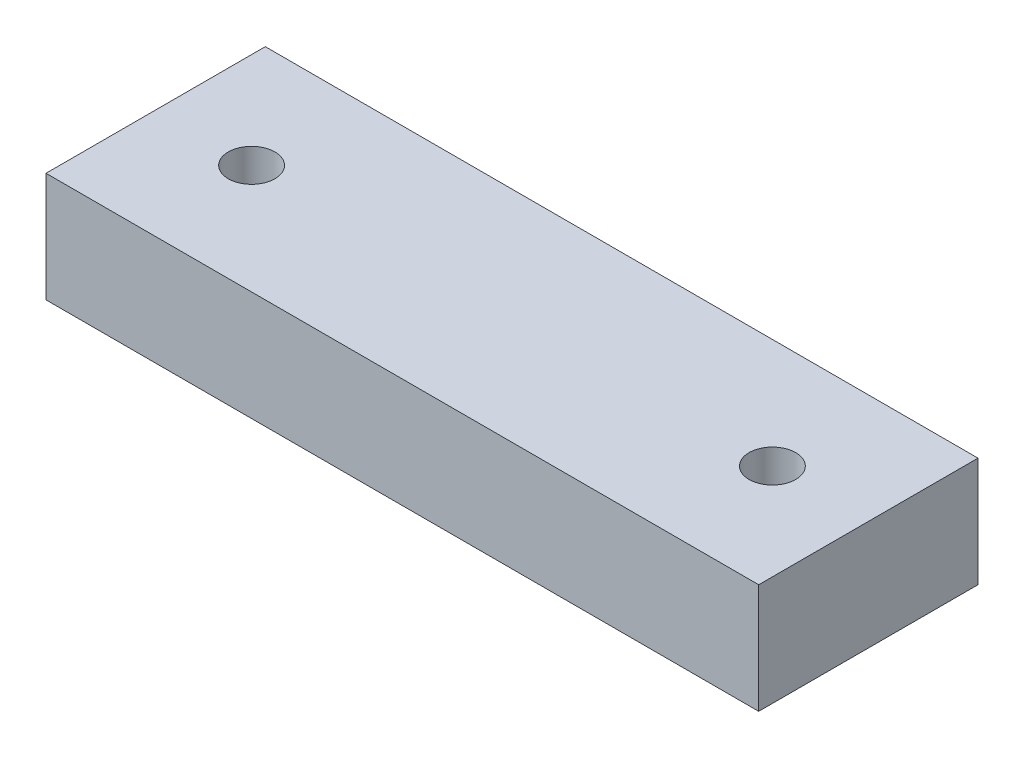
ISO-10303-21;
HEADER;
FILE_DESCRIPTION(('STEP AP214'),'2;1');
FILE_NAME('part.step','',(''),(''),'','','');
FILE_SCHEMA(('AUTOMOTIVE_DESIGN { 1 0 10303 214 1 1 1 1 }'));
ENDSEC;
DATA;
#1=APPLICATION_CONTEXT('core data for automotive mechanical design processes');
#2=APPLICATION_PROTOCOL_DEFINITION('international standard','automotive_design',2000,#1);
#3=PRODUCT_CONTEXT('',#1,'mechanical');
#4=PRODUCT('Part','Part','',(#3));
#5=PRODUCT_RELATED_PRODUCT_CATEGORY('part','',(#4));
#6=PRODUCT_DEFINITION_FORMATION('','',#4);
#7=PRODUCT_DEFINITION_CONTEXT('part definition',#1,'design');
#8=PRODUCT_DEFINITION('design','',#6,#7);
#9=PRODUCT_DEFINITION_SHAPE('','',#8);
#10=(LENGTH_UNIT() NAMED_UNIT(*) SI_UNIT(.MILLI.,.METRE.));
#11=(NAMED_UNIT(*) PLANE_ANGLE_UNIT() SI_UNIT($,.RADIAN.));
#12=(NAMED_UNIT(*) SI_UNIT($,.STERADIAN.) SOLID_ANGLE_UNIT());
#13=UNCERTAINTY_MEASURE_WITH_UNIT(LENGTH_MEASURE(1.E-05),#10,'distance_accuracy_value','');
#14=(GEOMETRIC_REPRESENTATION_CONTEXT(3) GLOBAL_UNCERTAINTY_ASSIGNED_CONTEXT((#13)) GLOBAL_UNIT_ASSIGNED_CONTEXT((#10,
#11,#12)) REPRESENTATION_CONTEXT('',''));
#15=CARTESIAN_POINT('',(0.,0.,0.));
#16=DIRECTION('',(0.,0.,1.));
#17=DIRECTION('',(1.,0.,0.));
#18=AXIS2_PLACEMENT_3D('',#15,#16,#17);
#19=CARTESIAN_POINT('',(65.,20.,-20.));
#20=DIRECTION('',(-1.,0.,0.));
#21=DIRECTION('',(0.,0.,1.));
#22=AXIS2_PLACEMENT_3D('',#19,#20,#21);
#23=PLANE('',#22);
#24=DIRECTION('',(0.,0.,-1.));
#25=VECTOR('',#24,1.);
#26=CARTESIAN_POINT('',(65.,0.,-20.));
#27=LINE('',#26,#25);
#28=CARTESIAN_POINT('',(65.,0.,20.));
#29=VERTEX_POINT('',#28);
#30=CARTESIAN_POINT('',(65.,0.,-20.));
#31=VERTEX_POINT('',#30);
#32=EDGE_CURVE('E104',#29,#31,#27,.T.);
#33=ORIENTED_EDGE('',*,*,#32,.T.);
#34=DIRECTION('',(0.,-1.,0.));
#35=VECTOR('',#34,1.);
#36=CARTESIAN_POINT('',(65.,20.,-20.));
#37=LINE('',#36,#35);
#38=CARTESIAN_POINT('',(65.,20.,-20.));
#39=VERTEX_POINT('',#38);
#40=EDGE_CURVE('E11',#39,#31,#37,.T.);
#41=ORIENTED_EDGE('',*,*,#40,.F.);
#42=DIRECTION('',(0.,0.,-1.));
#43=VECTOR('',#42,1.);
#44=CARTESIAN_POINT('',(65.,20.,-20.));
#45=LINE('',#44,#43);
#46=CARTESIAN_POINT('',(65.,20.,20.));
#47=VERTEX_POINT('',#46);
#48=EDGE_CURVE('E91',#47,#39,#45,.T.);
#49=ORIENTED_EDGE('',*,*,#48,.F.);
#50=DIRECTION('',(0.,-1.,0.));
#51=VECTOR('',#50,1.);
#52=CARTESIAN_POINT('',(65.,20.,20.));
#53=LINE('',#52,#51);
#54=EDGE_CURVE('E100',#47,#29,#53,.T.);
#55=ORIENTED_EDGE('',*,*,#54,.T.);
#56=EDGE_LOOP('',(#33,#41,#49,#55));
#57=FACE_BOUND('',#56,.T.);
#58=ADVANCED_FACE('F39',(#57),#23,.F.);
#59=CARTESIAN_POINT('',(-65.,20.,-20.));
#60=DIRECTION('',(0.,0.,1.));
#61=DIRECTION('',(1.,0.,0.));
#62=AXIS2_PLACEMENT_3D('',#59,#60,#61);
#63=PLANE('',#62);
#64=DIRECTION('',(-1.,0.,0.));
#65=VECTOR('',#64,1.);
#66=CARTESIAN_POINT('',(-65.,0.,-20.));
#67=LINE('',#66,#65);
#68=CARTESIAN_POINT('',(-65.,0.,-20.));
#69=VERTEX_POINT('',#68);
#70=EDGE_CURVE('E95',#31,#69,#67,.T.);
#71=ORIENTED_EDGE('',*,*,#70,.T.);
#72=DIRECTION('',(0.,-1.,0.));
#73=VECTOR('',#72,1.);
#74=CARTESIAN_POINT('',(-65.,20.,-20.));
#75=LINE('',#74,#73);
#76=CARTESIAN_POINT('',(-65.,20.,-20.));
#77=VERTEX_POINT('',#76);
#78=EDGE_CURVE('E48',#77,#69,#75,.T.);
#79=ORIENTED_EDGE('',*,*,#78,.F.);
#80=DIRECTION('',(-1.,0.,0.));
#81=VECTOR('',#80,1.);
#82=CARTESIAN_POINT('',(-65.,20.,-20.));
#83=LINE('',#82,#81);
#84=EDGE_CURVE('E86',#39,#77,#83,.T.);
#85=ORIENTED_EDGE('',*,*,#84,.F.);
#86=ORIENTED_EDGE('',*,*,#40,.T.);
#87=EDGE_LOOP('',(#71,#79,#85,#86));
#88=FACE_BOUND('',#87,.T.);
#89=ADVANCED_FACE('F94',(#88),#63,.F.);
#90=CARTESIAN_POINT('',(-65.,20.,-20.));
#91=DIRECTION('',(1.,0.,0.));
#92=DIRECTION('',(0.,0.,-1.));
#93=AXIS2_PLACEMENT_3D('',#90,#91,#92);
#94=PLANE('',#93);
#95=DIRECTION('',(0.,0.,1.));
#96=VECTOR('',#95,1.);
#97=CARTESIAN_POINT('',(-65.,0.,-20.));
#98=LINE('',#97,#96);
#99=CARTESIAN_POINT('',(-65.,0.,20.));
#100=VERTEX_POINT('',#99);
#101=EDGE_CURVE('E73',#69,#100,#98,.T.);
#102=ORIENTED_EDGE('',*,*,#101,.T.);
#103=DIRECTION('',(0.,-1.,0.));
#104=VECTOR('',#103,1.);
#105=CARTESIAN_POINT('',(-65.,20.,20.));
#106=LINE('',#105,#104);
#107=CARTESIAN_POINT('',(-65.,20.,20.));
#108=VERTEX_POINT('',#107);
#109=EDGE_CURVE('E96',#108,#100,#106,.T.);
#110=ORIENTED_EDGE('',*,*,#109,.F.);
#111=DIRECTION('',(0.,0.,1.));
#112=VECTOR('',#111,1.);
#113=CARTESIAN_POINT('',(-65.,20.,-20.));
#114=LINE('',#113,#112);
#115=EDGE_CURVE('E89',#77,#108,#114,.T.);
#116=ORIENTED_EDGE('',*,*,#115,.F.);
#117=ORIENTED_EDGE('',*,*,#78,.T.);
#118=EDGE_LOOP('',(#102,#110,#116,#117));
#119=FACE_BOUND('',#118,.T.);
#120=ADVANCED_FACE('F98',(#119),#94,.F.);
#121=CARTESIAN_POINT('',(-65.,20.,20.));
#122=DIRECTION('',(0.,0.,-1.));
#123=DIRECTION('',(-1.,0.,0.));
#124=AXIS2_PLACEMENT_3D('',#121,#122,#123);
#125=PLANE('',#124);
#126=DIRECTION('',(1.,0.,0.));
#127=VECTOR('',#126,1.);
#128=CARTESIAN_POINT('',(-65.,0.,20.));
#129=LINE('',#128,#127);
#130=EDGE_CURVE('E79',#100,#29,#129,.T.);
#131=ORIENTED_EDGE('',*,*,#130,.T.);
#132=ORIENTED_EDGE('',*,*,#54,.F.);
#133=DIRECTION('',(1.,0.,0.));
#134=VECTOR('',#133,1.);
#135=CARTESIAN_POINT('',(-65.,20.,20.));
#136=LINE('',#135,#134);
#137=EDGE_CURVE('E56',#108,#47,#136,.T.);
#138=ORIENTED_EDGE('',*,*,#137,.F.);
#139=ORIENTED_EDGE('',*,*,#109,.T.);
#140=EDGE_LOOP('',(#131,#132,#138,#139));
#141=FACE_BOUND('',#140,.T.);
#142=ADVANCED_FACE('F112',(#141),#125,.F.);
#143=CARTESIAN_POINT('',(0.,20.,0.));
#144=DIRECTION('',(0.,1.,0.));
#145=DIRECTION('',(0.,0.,1.));
#146=AXIS2_PLACEMENT_3D('',#143,#144,#145);
#147=PLANE('',#146);
#148=CARTESIAN_POINT('',(47.5,20.,0.));
#149=DIRECTION('',(0.,1.,0.));
#150=DIRECTION('',(0.,0.,1.));
#151=AXIS2_PLACEMENT_3D('',#148,#149,#150);
#152=CIRCLE('',#151,4.25);
#153=CARTESIAN_POINT('',(47.5,20.,4.25000000000001));
#154=VERTEX_POINT('',#153);
#155=EDGE_CURVE('E123',#154,#154,#152,.T.);
#156=ORIENTED_EDGE('',*,*,#155,.F.);
#157=EDGE_LOOP('',(#156));
#158=FACE_BOUND('',#157,.T.);
#159=CARTESIAN_POINT('',(-47.5,20.,0.));
#160=DIRECTION('',(0.,1.,0.));
#161=DIRECTION('',(0.,0.,1.));
#162=AXIS2_PLACEMENT_3D('',#159,#160,#161);
#163=CIRCLE('',#162,4.25);
#164=CARTESIAN_POINT('',(-47.5,20.,4.25000000000002));
#165=VERTEX_POINT('',#164);
#166=EDGE_CURVE('E120',#165,#165,#163,.T.);
#167=ORIENTED_EDGE('',*,*,#166,.F.);
#168=EDGE_LOOP('',(#167));
#169=FACE_BOUND('',#168,.T.);
#170=ORIENTED_EDGE('',*,*,#48,.T.);
#171=ORIENTED_EDGE('',*,*,#84,.T.);
#172=ORIENTED_EDGE('',*,*,#115,.T.);
#173=ORIENTED_EDGE('',*,*,#137,.T.);
#174=EDGE_LOOP('',(#170,#171,#172,#173));
#175=FACE_BOUND('',#174,.T.);
#176=ADVANCED_FACE('F87',(#158,#169,#175),#147,.T.);
#177=CARTESIAN_POINT('',(0.,0.,0.));
#178=DIRECTION('',(0.,1.,0.));
#179=DIRECTION('',(0.,0.,1.));
#180=AXIS2_PLACEMENT_3D('',#177,#178,#179);
#181=PLANE('',#180);
#182=CARTESIAN_POINT('',(47.5,0.,0.));
#183=DIRECTION('',(0.,1.,0.));
#184=DIRECTION('',(0.,0.,1.));
#185=AXIS2_PLACEMENT_3D('',#182,#183,#184);
#186=CIRCLE('',#185,4.25);
#187=CARTESIAN_POINT('',(47.5,0.,4.25000000000001));
#188=VERTEX_POINT('',#187);
#189=EDGE_CURVE('E42',#188,#188,#186,.T.);
#190=ORIENTED_EDGE('',*,*,#189,.T.);
#191=EDGE_LOOP('',(#190));
#192=FACE_BOUND('',#191,.T.);
#193=CARTESIAN_POINT('',(-47.5,0.,0.));
#194=DIRECTION('',(0.,1.,0.));
#195=DIRECTION('',(0.,0.,1.));
#196=AXIS2_PLACEMENT_3D('',#193,#194,#195);
#197=CIRCLE('',#196,4.25);
#198=CARTESIAN_POINT('',(-47.5,0.,4.25000000000002));
#199=VERTEX_POINT('',#198);
#200=EDGE_CURVE('E107',#199,#199,#197,.T.);
#201=ORIENTED_EDGE('',*,*,#200,.T.);
#202=EDGE_LOOP('',(#201));
#203=FACE_BOUND('',#202,.T.);
#204=ORIENTED_EDGE('',*,*,#32,.F.);
#205=ORIENTED_EDGE('',*,*,#130,.F.);
#206=ORIENTED_EDGE('',*,*,#101,.F.);
#207=ORIENTED_EDGE('',*,*,#70,.F.);
#208=EDGE_LOOP('',(#204,#205,#206,#207));
#209=FACE_BOUND('',#208,.T.);
#210=ADVANCED_FACE('F115',(#192,#203,#209),#181,.F.);
#211=CARTESIAN_POINT('',(-47.5,20.,0.));
#212=DIRECTION('',(0.,1.,0.));
#213=DIRECTION('',(0.,0.,1.));
#214=AXIS2_PLACEMENT_3D('',#211,#212,#213);
#215=CYLINDRICAL_SURFACE('',#214,4.25);
#216=ORIENTED_EDGE('',*,*,#166,.T.);
#217=EDGE_LOOP('',(#216));
#218=FACE_BOUND('',#217,.T.);
#219=ORIENTED_EDGE('',*,*,#200,.F.);
#220=EDGE_LOOP('',(#219));
#221=FACE_BOUND('',#220,.T.);
#222=ADVANCED_FACE('F134',(#218,#221),#215,.F.);
#223=CARTESIAN_POINT('',(47.5,20.,0.));
#224=DIRECTION('',(0.,1.,0.));
#225=DIRECTION('',(0.,0.,1.));
#226=AXIS2_PLACEMENT_3D('',#223,#224,#225);
#227=CYLINDRICAL_SURFACE('',#226,4.25);
#228=ORIENTED_EDGE('',*,*,#155,.T.);
#229=EDGE_LOOP('',(#228));
#230=FACE_BOUND('',#229,.T.);
#231=ORIENTED_EDGE('',*,*,#189,.F.);
#232=EDGE_LOOP('',(#231));
#233=FACE_BOUND('',#232,.T.);
#234=ADVANCED_FACE('F132',(#230,#233),#227,.F.);
#235=CLOSED_SHELL('',(#58,#89,#120,#142,#176,#210,#222,#234));
#236=MANIFOLD_SOLID_BREP('B2',#235);
#237=ADVANCED_BREP_SHAPE_REPRESENTATION('',(#18,#236),#14);
#238=SHAPE_DEFINITION_REPRESENTATION(#9,#237);
ENDSEC;
END-ISO-10303-21;
